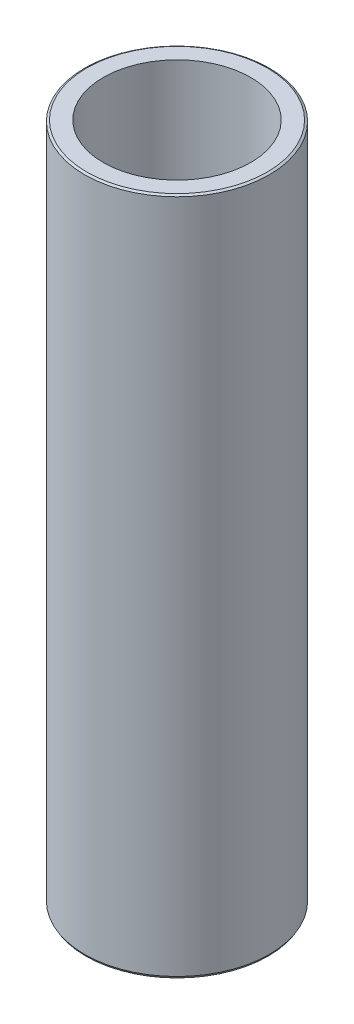
ISO-10303-21;
HEADER;
FILE_DESCRIPTION(('STEP AP214'),'2;1');
FILE_NAME('part.step','',(''),(''),'','','');
FILE_SCHEMA(('AUTOMOTIVE_DESIGN { 1 0 10303 214 1 1 1 1 }'));
ENDSEC;
DATA;
#1=APPLICATION_CONTEXT('core data for automotive mechanical design processes');
#2=APPLICATION_PROTOCOL_DEFINITION('international standard','automotive_design',2000,#1);
#3=PRODUCT_CONTEXT('',#1,'mechanical');
#4=PRODUCT('Part','Part','',(#3));
#5=PRODUCT_RELATED_PRODUCT_CATEGORY('part','',(#4));
#6=PRODUCT_DEFINITION_FORMATION('','',#4);
#7=PRODUCT_DEFINITION_CONTEXT('part definition',#1,'design');
#8=PRODUCT_DEFINITION('design','',#6,#7);
#9=PRODUCT_DEFINITION_SHAPE('','',#8);
#10=(LENGTH_UNIT() NAMED_UNIT(*) SI_UNIT(.MILLI.,.METRE.));
#11=(NAMED_UNIT(*) PLANE_ANGLE_UNIT() SI_UNIT($,.RADIAN.));
#12=(NAMED_UNIT(*) SI_UNIT($,.STERADIAN.) SOLID_ANGLE_UNIT());
#13=UNCERTAINTY_MEASURE_WITH_UNIT(LENGTH_MEASURE(1.E-05),#10,'distance_accuracy_value','');
#14=(GEOMETRIC_REPRESENTATION_CONTEXT(3) GLOBAL_UNCERTAINTY_ASSIGNED_CONTEXT((#13)) GLOBAL_UNIT_ASSIGNED_CONTEXT((#10,
#11,#12)) REPRESENTATION_CONTEXT('',''));
#15=CARTESIAN_POINT('',(0.,0.,0.));
#16=DIRECTION('',(0.,0.,1.));
#17=DIRECTION('',(1.,0.,0.));
#18=AXIS2_PLACEMENT_3D('',#15,#16,#17);
#19=CARTESIAN_POINT('',(0.,367.390058799377,0.));
#20=DIRECTION('',(0.,-1.,0.));
#21=DIRECTION('',(0.,0.,-1.));
#22=AXIS2_PLACEMENT_3D('',#19,#20,#21);
#23=CYLINDRICAL_SURFACE('',#22,50.);
#24=CARTESIAN_POINT('',(0.,366.717894128619,0.));
#25=DIRECTION('',(0.,1.,0.));
#26=DIRECTION('',(0.,0.,1.));
#27=AXIS2_PLACEMENT_3D('',#24,#25,#26);
#28=CIRCLE('',#27,50.);
#29=CARTESIAN_POINT('',(0.,366.717894128619,50.));
#30=VERTEX_POINT('',#29);
#31=EDGE_CURVE('E50',#30,#30,#28,.F.);
#32=ORIENTED_EDGE('',*,*,#31,.T.);
#33=EDGE_LOOP('',(#32));
#34=FACE_BOUND('',#33,.T.);
#35=CARTESIAN_POINT('',(0.,1.16422336080624,0.));
#36=DIRECTION('',(0.,1.,0.));
#37=DIRECTION('',(0.,0.,1.));
#38=AXIS2_PLACEMENT_3D('',#35,#36,#37);
#39=CIRCLE('',#38,50.);
#40=CARTESIAN_POINT('',(0.,1.16422336080624,50.));
#41=VERTEX_POINT('',#40);
#42=EDGE_CURVE('E51',#41,#41,#39,.T.);
#43=ORIENTED_EDGE('',*,*,#42,.T.);
#44=EDGE_LOOP('',(#43));
#45=FACE_BOUND('',#44,.T.);
#46=ADVANCED_FACE('F39',(#34,#45),#23,.T.);
#47=CARTESIAN_POINT('',(0.,367.390058799377,0.));
#48=DIRECTION('',(0.,1.,0.));
#49=DIRECTION('',(0.,0.,1.));
#50=AXIS2_PLACEMENT_3D('',#47,#48,#49);
#51=PLANE('',#50);
#52=CARTESIAN_POINT('',(0.,367.390058799377,0.));
#53=DIRECTION('',(0.,1.,0.));
#54=DIRECTION('',(0.,0.,1.));
#55=AXIS2_PLACEMENT_3D('',#52,#53,#54);
#56=CIRCLE('',#55,48.8357766391937);
#57=CARTESIAN_POINT('',(0.,367.390058799377,48.8357766391937));
#58=VERTEX_POINT('',#57);
#59=EDGE_CURVE('E54',#58,#58,#56,.T.);
#60=ORIENTED_EDGE('',*,*,#59,.T.);
#61=EDGE_LOOP('',(#60));
#62=FACE_BOUND('',#61,.T.);
#63=CARTESIAN_POINT('',(0.,367.390058799377,0.));
#64=DIRECTION('',(0.,1.,0.));
#65=DIRECTION('',(0.,0.,1.));
#66=AXIS2_PLACEMENT_3D('',#63,#64,#65);
#67=CIRCLE('',#66,39.9120274877767);
#68=CARTESIAN_POINT('',(0.,367.390058799377,39.9120274877767));
#69=VERTEX_POINT('',#68);
#70=EDGE_CURVE('E58',#69,#69,#67,.T.);
#71=ORIENTED_EDGE('',*,*,#70,.F.);
#72=EDGE_LOOP('',(#71));
#73=FACE_BOUND('',#72,.T.);
#74=ADVANCED_FACE('F69',(#62,#73),#51,.T.);
#75=CARTESIAN_POINT('',(0.,0.,0.));
#76=DIRECTION('',(0.,1.,0.));
#77=DIRECTION('',(0.,0.,1.));
#78=AXIS2_PLACEMENT_3D('',#75,#76,#77);
#79=PLANE('',#78);
#80=CARTESIAN_POINT('',(0.,0.,0.));
#81=DIRECTION('',(0.,1.,0.));
#82=DIRECTION('',(0.,0.,1.));
#83=AXIS2_PLACEMENT_3D('',#80,#81,#82);
#84=CIRCLE('',#83,49.3278353292417);
#85=CARTESIAN_POINT('',(0.,0.,49.3278353292417));
#86=VERTEX_POINT('',#85);
#87=EDGE_CURVE('E10',#86,#86,#84,.F.);
#88=ORIENTED_EDGE('',*,*,#87,.T.);
#89=EDGE_LOOP('',(#88));
#90=FACE_BOUND('',#89,.T.);
#91=CARTESIAN_POINT('',(0.,0.,0.));
#92=DIRECTION('',(0.,1.,0.));
#93=DIRECTION('',(0.,0.,1.));
#94=AXIS2_PLACEMENT_3D('',#91,#92,#93);
#95=CIRCLE('',#94,39.9120274877767);
#96=CARTESIAN_POINT('',(0.,0.,39.9120274877767));
#97=VERTEX_POINT('',#96);
#98=EDGE_CURVE('E63',#97,#97,#95,.T.);
#99=ORIENTED_EDGE('',*,*,#98,.T.);
#100=EDGE_LOOP('',(#99));
#101=FACE_BOUND('',#100,.T.);
#102=ADVANCED_FACE('F75',(#90,#101),#79,.F.);
#103=CARTESIAN_POINT('',(0.,367.390058799377,0.));
#104=DIRECTION('',(0.,-1.,0.));
#105=DIRECTION('',(0.,0.,-1.));
#106=AXIS2_PLACEMENT_3D('',#103,#104,#105);
#107=CYLINDRICAL_SURFACE('',#106,39.9120274877767);
#108=ORIENTED_EDGE('',*,*,#70,.T.);
#109=EDGE_LOOP('',(#108));
#110=FACE_BOUND('',#109,.T.);
#111=ORIENTED_EDGE('',*,*,#98,.F.);
#112=EDGE_LOOP('',(#111));
#113=FACE_BOUND('',#112,.T.);
#114=ADVANCED_FACE('F70',(#110,#113),#107,.F.);
#115=CARTESIAN_POINT('',(0.,367.390058799377,0.));
#116=DIRECTION('',(0.,-1.,0.));
#117=DIRECTION('',(0.,0.,-1.));
#118=AXIS2_PLACEMENT_3D('',#115,#116,#117);
#119=CONICAL_SURFACE('',#118,48.8357766391937,1.0471975511966);
#120=ORIENTED_EDGE('',*,*,#31,.F.);
#121=EDGE_LOOP('',(#120));
#122=FACE_BOUND('',#121,.T.);
#123=ORIENTED_EDGE('',*,*,#59,.F.);
#124=EDGE_LOOP('',(#123));
#125=FACE_BOUND('',#124,.T.);
#126=ADVANCED_FACE('F81',(#122,#125),#119,.T.);
#127=CARTESIAN_POINT('',(0.,1.16422336080624,0.));
#128=DIRECTION('',(0.,1.,0.));
#129=DIRECTION('',(0.,0.,1.));
#130=AXIS2_PLACEMENT_3D('',#127,#128,#129);
#131=CONICAL_SURFACE('',#130,50.,0.523598775598295);
#132=ORIENTED_EDGE('',*,*,#87,.F.);
#133=EDGE_LOOP('',(#132));
#134=FACE_BOUND('',#133,.T.);
#135=ORIENTED_EDGE('',*,*,#42,.F.);
#136=EDGE_LOOP('',(#135));
#137=FACE_BOUND('',#136,.T.);
#138=ADVANCED_FACE('F45',(#134,#137),#131,.T.);
#139=CLOSED_SHELL('',(#46,#74,#102,#114,#126,#138));
#140=MANIFOLD_SOLID_BREP('B2',#139);
#141=ADVANCED_BREP_SHAPE_REPRESENTATION('',(#18,#140),#14);
#142=SHAPE_DEFINITION_REPRESENTATION(#9,#141);
ENDSEC;
END-ISO-10303-21;
